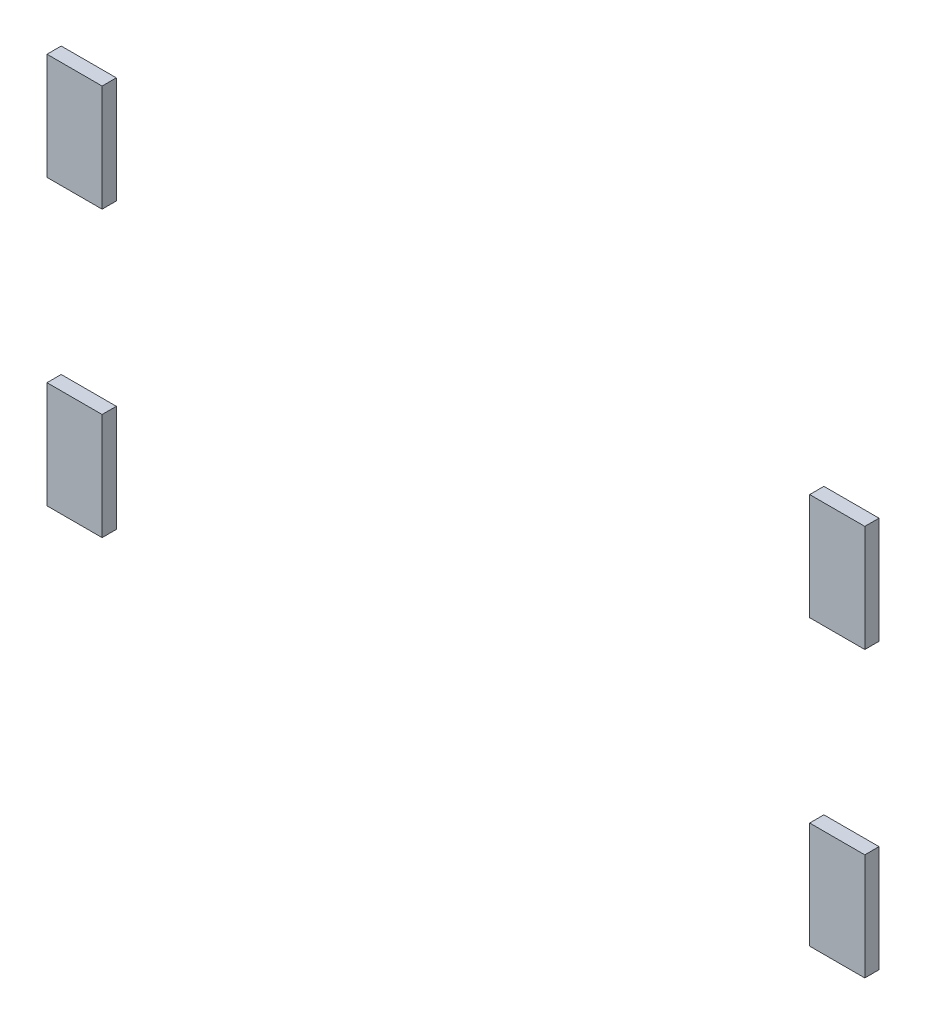
ISO-10303-21;
HEADER;
FILE_DESCRIPTION(('STEP AP214'),'2;1');
FILE_NAME('part.step','',(''),(''),'','','');
FILE_SCHEMA(('AUTOMOTIVE_DESIGN { 1 0 10303 214 1 1 1 1 }'));
ENDSEC;
DATA;
#1=APPLICATION_CONTEXT('core data for automotive mechanical design processes');
#2=APPLICATION_PROTOCOL_DEFINITION('international standard','automotive_design',2000,#1);
#3=PRODUCT_CONTEXT('',#1,'mechanical');
#4=PRODUCT('Part','Part','',(#3));
#5=PRODUCT_RELATED_PRODUCT_CATEGORY('part','',(#4));
#6=PRODUCT_DEFINITION_FORMATION('','',#4);
#7=PRODUCT_DEFINITION_CONTEXT('part definition',#1,'design');
#8=PRODUCT_DEFINITION('design','',#6,#7);
#9=PRODUCT_DEFINITION_SHAPE('','',#8);
#10=(LENGTH_UNIT() NAMED_UNIT(*) SI_UNIT(.MILLI.,.METRE.));
#11=(NAMED_UNIT(*) PLANE_ANGLE_UNIT() SI_UNIT($,.RADIAN.));
#12=(NAMED_UNIT(*) SI_UNIT($,.STERADIAN.) SOLID_ANGLE_UNIT());
#13=UNCERTAINTY_MEASURE_WITH_UNIT(LENGTH_MEASURE(1.E-05),#10,'distance_accuracy_value','');
#14=(GEOMETRIC_REPRESENTATION_CONTEXT(3) GLOBAL_UNCERTAINTY_ASSIGNED_CONTEXT((#13)) GLOBAL_UNIT_ASSIGNED_CONTEXT((#10,
#11,#12)) REPRESENTATION_CONTEXT('',''));
#15=CARTESIAN_POINT('',(0.,0.,0.));
#16=DIRECTION('',(0.,0.,1.));
#17=DIRECTION('',(1.,0.,0.));
#18=AXIS2_PLACEMENT_3D('',#15,#16,#17);
#19=CARTESIAN_POINT('',(0.,0.,0.));
#20=DIRECTION('',(0.,0.,-1.));
#21=DIRECTION('',(-1.,0.,0.));
#22=AXIS2_PLACEMENT_3D('',#19,#20,#21);
#23=PLANE('',#22);
#24=DIRECTION('',(1.,0.,0.));
#25=VECTOR('',#24,1.);
#26=CARTESIAN_POINT('',(-2.145,1.1,0.));
#27=LINE('',#26,#25);
#28=CARTESIAN_POINT('',(-1.99,1.1,0.));
#29=VERTEX_POINT('',#28);
#30=CARTESIAN_POINT('',(-2.3,1.1,0.));
#31=VERTEX_POINT('',#30);
#32=EDGE_CURVE('P0_E68',#29,#31,#27,.F.);
#33=ORIENTED_EDGE('',*,*,#32,.F.);
#34=DIRECTION('',(0.,1.,0.));
#35=VECTOR('',#34,1.);
#36=CARTESIAN_POINT('',(-1.99,0.8,0.));
#37=LINE('',#36,#35);
#38=CARTESIAN_POINT('',(-1.99,0.5,0.));
#39=VERTEX_POINT('',#38);
#40=EDGE_CURVE('P0_E20',#39,#29,#37,.T.);
#41=ORIENTED_EDGE('',*,*,#40,.F.);
#42=DIRECTION('',(1.,0.,0.));
#43=VECTOR('',#42,1.);
#44=CARTESIAN_POINT('',(-2.145,0.5,0.));
#45=LINE('',#44,#43);
#46=CARTESIAN_POINT('',(-2.3,0.5,0.));
#47=VERTEX_POINT('',#46);
#48=EDGE_CURVE('P0_E58',#47,#39,#45,.T.);
#49=ORIENTED_EDGE('',*,*,#48,.F.);
#50=DIRECTION('',(0.,1.,0.));
#51=VECTOR('',#50,1.);
#52=CARTESIAN_POINT('',(-2.3,0.8,0.));
#53=LINE('',#52,#51);
#54=EDGE_CURVE('P0_E53',#31,#47,#53,.F.);
#55=ORIENTED_EDGE('',*,*,#54,.F.);
#56=EDGE_LOOP('',(#33,#41,#49,#55));
#57=FACE_BOUND('',#56,.T.);
#58=ADVANCED_FACE('P0_F17',(#57),#23,.T.);
#59=CARTESIAN_POINT('',(-1.99,0.8,0.));
#60=DIRECTION('',(1.,0.,0.));
#61=DIRECTION('',(0.,0.,-1.));
#62=AXIS2_PLACEMENT_3D('',#59,#60,#61);
#63=PLANE('',#62);
#64=DIRECTION('',(0.,1.,0.));
#65=VECTOR('',#64,1.);
#66=CARTESIAN_POINT('',(-1.99,0.,0.08));
#67=LINE('',#66,#65);
#68=CARTESIAN_POINT('',(-1.99,1.1,0.08));
#69=VERTEX_POINT('',#68);
#70=CARTESIAN_POINT('',(-1.99,0.5,0.08));
#71=VERTEX_POINT('',#70);
#72=EDGE_CURVE('P0_E74',#69,#71,#67,.F.);
#73=ORIENTED_EDGE('',*,*,#72,.T.);
#74=DIRECTION('',(0.,0.,-1.));
#75=VECTOR('',#74,1.);
#76=CARTESIAN_POINT('',(-1.99,0.5,0.));
#77=LINE('',#76,#75);
#78=EDGE_CURVE('P0_E63',#39,#71,#77,.F.);
#79=ORIENTED_EDGE('',*,*,#78,.F.);
#80=ORIENTED_EDGE('',*,*,#40,.T.);
#81=DIRECTION('',(0.,0.,1.));
#82=VECTOR('',#81,1.);
#83=CARTESIAN_POINT('',(-1.99,1.1,0.));
#84=LINE('',#83,#82);
#85=EDGE_CURVE('P0_E81',#69,#29,#84,.F.);
#86=ORIENTED_EDGE('',*,*,#85,.F.);
#87=EDGE_LOOP('',(#73,#79,#80,#86));
#88=FACE_BOUND('',#87,.T.);
#89=ADVANCED_FACE('P0_F73',(#88),#63,.T.);
#90=CARTESIAN_POINT('',(-2.145,0.5,0.));
#91=DIRECTION('',(0.,-1.,0.));
#92=DIRECTION('',(0.,0.,-1.));
#93=AXIS2_PLACEMENT_3D('',#90,#91,#92);
#94=PLANE('',#93);
#95=DIRECTION('',(-1.,0.,0.));
#96=VECTOR('',#95,1.);
#97=CARTESIAN_POINT('',(0.,0.5,0.08));
#98=LINE('',#97,#96);
#99=CARTESIAN_POINT('',(-2.3,0.5,0.08));
#100=VERTEX_POINT('',#99);
#101=EDGE_CURVE('P0_E84',#71,#100,#98,.T.);
#102=ORIENTED_EDGE('',*,*,#101,.T.);
#103=DIRECTION('',(0.,0.,1.));
#104=VECTOR('',#103,1.);
#105=CARTESIAN_POINT('',(-2.3,0.5,0.));
#106=LINE('',#105,#104);
#107=EDGE_CURVE('P0_E65',#47,#100,#106,.T.);
#108=ORIENTED_EDGE('',*,*,#107,.F.);
#109=ORIENTED_EDGE('',*,*,#48,.T.);
#110=ORIENTED_EDGE('',*,*,#78,.T.);
#111=EDGE_LOOP('',(#102,#108,#109,#110));
#112=FACE_BOUND('',#111,.T.);
#113=ADVANCED_FACE('P0_F61',(#112),#94,.T.);
#114=CARTESIAN_POINT('',(-2.3,0.8,0.));
#115=DIRECTION('',(-1.,0.,0.));
#116=DIRECTION('',(0.,0.,1.));
#117=AXIS2_PLACEMENT_3D('',#114,#115,#116);
#118=PLANE('',#117);
#119=DIRECTION('',(0.,1.,0.));
#120=VECTOR('',#119,1.);
#121=CARTESIAN_POINT('',(-2.3,0.,0.08));
#122=LINE('',#121,#120);
#123=CARTESIAN_POINT('',(-2.3,1.1,0.08));
#124=VERTEX_POINT('',#123);
#125=EDGE_CURVE('P0_E26',#100,#124,#122,.T.);
#126=ORIENTED_EDGE('',*,*,#125,.T.);
#127=DIRECTION('',(0.,0.,1.));
#128=VECTOR('',#127,1.);
#129=CARTESIAN_POINT('',(-2.3,1.1,0.));
#130=LINE('',#129,#128);
#131=EDGE_CURVE('P0_E34',#31,#124,#130,.T.);
#132=ORIENTED_EDGE('',*,*,#131,.F.);
#133=ORIENTED_EDGE('',*,*,#54,.T.);
#134=ORIENTED_EDGE('',*,*,#107,.T.);
#135=EDGE_LOOP('',(#126,#132,#133,#134));
#136=FACE_BOUND('',#135,.T.);
#137=ADVANCED_FACE('P0_F88',(#136),#118,.T.);
#138=CARTESIAN_POINT('',(-2.145,1.1,0.));
#139=DIRECTION('',(0.,1.,0.));
#140=DIRECTION('',(0.,0.,1.));
#141=AXIS2_PLACEMENT_3D('',#138,#139,#140);
#142=PLANE('',#141);
#143=DIRECTION('',(-1.,0.,0.));
#144=VECTOR('',#143,1.);
#145=CARTESIAN_POINT('',(0.,1.1,0.08));
#146=LINE('',#145,#144);
#147=EDGE_CURVE('P0_E11',#124,#69,#146,.F.);
#148=ORIENTED_EDGE('',*,*,#147,.T.);
#149=ORIENTED_EDGE('',*,*,#85,.T.);
#150=ORIENTED_EDGE('',*,*,#32,.T.);
#151=ORIENTED_EDGE('',*,*,#131,.T.);
#152=EDGE_LOOP('',(#148,#149,#150,#151));
#153=FACE_BOUND('',#152,.T.);
#154=ADVANCED_FACE('P0_F91',(#153),#142,.T.);
#155=CARTESIAN_POINT('',(0.,0.,0.08));
#156=DIRECTION('',(0.,0.,-1.));
#157=DIRECTION('',(-1.,0.,0.));
#158=AXIS2_PLACEMENT_3D('',#155,#156,#157);
#159=PLANE('',#158);
#160=ORIENTED_EDGE('',*,*,#125,.F.);
#161=ORIENTED_EDGE('',*,*,#101,.F.);
#162=ORIENTED_EDGE('',*,*,#72,.F.);
#163=ORIENTED_EDGE('',*,*,#147,.F.);
#164=EDGE_LOOP('',(#160,#161,#162,#163));
#165=FACE_BOUND('',#164,.T.);
#166=ADVANCED_FACE('P0_F90',(#165),#159,.F.);
#167=CLOSED_SHELL('',(#58,#89,#113,#137,#154,#166));
#168=MANIFOLD_SOLID_BREP('P0_B1',#167);
#169=CARTESIAN_POINT('',(0.,0.,0.));
#170=DIRECTION('',(0.,0.,-1.));
#171=DIRECTION('',(-1.,0.,0.));
#172=AXIS2_PLACEMENT_3D('',#169,#170,#171);
#173=PLANE('',#172);
#174=DIRECTION('',(1.,0.,0.));
#175=VECTOR('',#174,1.);
#176=CARTESIAN_POINT('',(-2.145,-0.5,0.));
#177=LINE('',#176,#175);
#178=CARTESIAN_POINT('',(-1.99,-0.5,0.));
#179=VERTEX_POINT('',#178);
#180=CARTESIAN_POINT('',(-2.3,-0.5,0.));
#181=VERTEX_POINT('',#180);
#182=EDGE_CURVE('P1_E68',#179,#181,#177,.F.);
#183=ORIENTED_EDGE('',*,*,#182,.F.);
#184=DIRECTION('',(0.,1.,0.));
#185=VECTOR('',#184,1.);
#186=CARTESIAN_POINT('',(-1.99,-0.8,0.));
#187=LINE('',#186,#185);
#188=CARTESIAN_POINT('',(-1.99,-1.1,0.));
#189=VERTEX_POINT('',#188);
#190=EDGE_CURVE('P1_E20',#189,#179,#187,.T.);
#191=ORIENTED_EDGE('',*,*,#190,.F.);
#192=DIRECTION('',(1.,0.,0.));
#193=VECTOR('',#192,1.);
#194=CARTESIAN_POINT('',(-2.145,-1.1,0.));
#195=LINE('',#194,#193);
#196=CARTESIAN_POINT('',(-2.3,-1.1,0.));
#197=VERTEX_POINT('',#196);
#198=EDGE_CURVE('P1_E58',#197,#189,#195,.T.);
#199=ORIENTED_EDGE('',*,*,#198,.F.);
#200=DIRECTION('',(0.,1.,0.));
#201=VECTOR('',#200,1.);
#202=CARTESIAN_POINT('',(-2.3,-0.8,0.));
#203=LINE('',#202,#201);
#204=EDGE_CURVE('P1_E53',#181,#197,#203,.F.);
#205=ORIENTED_EDGE('',*,*,#204,.F.);
#206=EDGE_LOOP('',(#183,#191,#199,#205));
#207=FACE_BOUND('',#206,.T.);
#208=ADVANCED_FACE('P1_F17',(#207),#173,.T.);
#209=CARTESIAN_POINT('',(-1.99,-0.8,0.));
#210=DIRECTION('',(1.,0.,0.));
#211=DIRECTION('',(0.,0.,-1.));
#212=AXIS2_PLACEMENT_3D('',#209,#210,#211);
#213=PLANE('',#212);
#214=DIRECTION('',(0.,1.,0.));
#215=VECTOR('',#214,1.);
#216=CARTESIAN_POINT('',(-1.99,0.,0.08));
#217=LINE('',#216,#215);
#218=CARTESIAN_POINT('',(-1.99,-0.5,0.08));
#219=VERTEX_POINT('',#218);
#220=CARTESIAN_POINT('',(-1.99,-1.1,0.08));
#221=VERTEX_POINT('',#220);
#222=EDGE_CURVE('P1_E74',#219,#221,#217,.F.);
#223=ORIENTED_EDGE('',*,*,#222,.T.);
#224=DIRECTION('',(0.,0.,-1.));
#225=VECTOR('',#224,1.);
#226=CARTESIAN_POINT('',(-1.99,-1.1,0.));
#227=LINE('',#226,#225);
#228=EDGE_CURVE('P1_E63',#189,#221,#227,.F.);
#229=ORIENTED_EDGE('',*,*,#228,.F.);
#230=ORIENTED_EDGE('',*,*,#190,.T.);
#231=DIRECTION('',(0.,0.,1.));
#232=VECTOR('',#231,1.);
#233=CARTESIAN_POINT('',(-1.99,-0.5,0.));
#234=LINE('',#233,#232);
#235=EDGE_CURVE('P1_E81',#219,#179,#234,.F.);
#236=ORIENTED_EDGE('',*,*,#235,.F.);
#237=EDGE_LOOP('',(#223,#229,#230,#236));
#238=FACE_BOUND('',#237,.T.);
#239=ADVANCED_FACE('P1_F73',(#238),#213,.T.);
#240=CARTESIAN_POINT('',(-2.145,-1.1,0.));
#241=DIRECTION('',(0.,-1.,0.));
#242=DIRECTION('',(0.,0.,-1.));
#243=AXIS2_PLACEMENT_3D('',#240,#241,#242);
#244=PLANE('',#243);
#245=DIRECTION('',(-1.,0.,0.));
#246=VECTOR('',#245,1.);
#247=CARTESIAN_POINT('',(0.,-1.1,0.08));
#248=LINE('',#247,#246);
#249=CARTESIAN_POINT('',(-2.3,-1.1,0.08));
#250=VERTEX_POINT('',#249);
#251=EDGE_CURVE('P1_E84',#221,#250,#248,.T.);
#252=ORIENTED_EDGE('',*,*,#251,.T.);
#253=DIRECTION('',(0.,0.,1.));
#254=VECTOR('',#253,1.);
#255=CARTESIAN_POINT('',(-2.3,-1.1,0.));
#256=LINE('',#255,#254);
#257=EDGE_CURVE('P1_E65',#197,#250,#256,.T.);
#258=ORIENTED_EDGE('',*,*,#257,.F.);
#259=ORIENTED_EDGE('',*,*,#198,.T.);
#260=ORIENTED_EDGE('',*,*,#228,.T.);
#261=EDGE_LOOP('',(#252,#258,#259,#260));
#262=FACE_BOUND('',#261,.T.);
#263=ADVANCED_FACE('P1_F61',(#262),#244,.T.);
#264=CARTESIAN_POINT('',(-2.3,-0.8,0.));
#265=DIRECTION('',(-1.,0.,0.));
#266=DIRECTION('',(0.,0.,1.));
#267=AXIS2_PLACEMENT_3D('',#264,#265,#266);
#268=PLANE('',#267);
#269=DIRECTION('',(0.,1.,0.));
#270=VECTOR('',#269,1.);
#271=CARTESIAN_POINT('',(-2.3,0.,0.08));
#272=LINE('',#271,#270);
#273=CARTESIAN_POINT('',(-2.3,-0.5,0.08));
#274=VERTEX_POINT('',#273);
#275=EDGE_CURVE('P1_E26',#250,#274,#272,.T.);
#276=ORIENTED_EDGE('',*,*,#275,.T.);
#277=DIRECTION('',(0.,0.,1.));
#278=VECTOR('',#277,1.);
#279=CARTESIAN_POINT('',(-2.3,-0.5,0.));
#280=LINE('',#279,#278);
#281=EDGE_CURVE('P1_E34',#181,#274,#280,.T.);
#282=ORIENTED_EDGE('',*,*,#281,.F.);
#283=ORIENTED_EDGE('',*,*,#204,.T.);
#284=ORIENTED_EDGE('',*,*,#257,.T.);
#285=EDGE_LOOP('',(#276,#282,#283,#284));
#286=FACE_BOUND('',#285,.T.);
#287=ADVANCED_FACE('P1_F88',(#286),#268,.T.);
#288=CARTESIAN_POINT('',(-2.145,-0.5,0.));
#289=DIRECTION('',(0.,1.,0.));
#290=DIRECTION('',(0.,0.,1.));
#291=AXIS2_PLACEMENT_3D('',#288,#289,#290);
#292=PLANE('',#291);
#293=DIRECTION('',(-1.,0.,0.));
#294=VECTOR('',#293,1.);
#295=CARTESIAN_POINT('',(0.,-0.5,0.08));
#296=LINE('',#295,#294);
#297=EDGE_CURVE('P1_E11',#274,#219,#296,.F.);
#298=ORIENTED_EDGE('',*,*,#297,.T.);
#299=ORIENTED_EDGE('',*,*,#235,.T.);
#300=ORIENTED_EDGE('',*,*,#182,.T.);
#301=ORIENTED_EDGE('',*,*,#281,.T.);
#302=EDGE_LOOP('',(#298,#299,#300,#301));
#303=FACE_BOUND('',#302,.T.);
#304=ADVANCED_FACE('P1_F91',(#303),#292,.T.);
#305=CARTESIAN_POINT('',(0.,0.,0.08));
#306=DIRECTION('',(0.,0.,-1.));
#307=DIRECTION('',(-1.,0.,0.));
#308=AXIS2_PLACEMENT_3D('',#305,#306,#307);
#309=PLANE('',#308);
#310=ORIENTED_EDGE('',*,*,#275,.F.);
#311=ORIENTED_EDGE('',*,*,#251,.F.);
#312=ORIENTED_EDGE('',*,*,#222,.F.);
#313=ORIENTED_EDGE('',*,*,#297,.F.);
#314=EDGE_LOOP('',(#310,#311,#312,#313));
#315=FACE_BOUND('',#314,.T.);
#316=ADVANCED_FACE('P1_F90',(#315),#309,.F.);
#317=CLOSED_SHELL('',(#208,#239,#263,#287,#304,#316));
#318=MANIFOLD_SOLID_BREP('P1_B1',#317);
#319=CARTESIAN_POINT('',(0.,0.,0.));
#320=DIRECTION('',(0.,0.,-1.));
#321=DIRECTION('',(-1.,0.,0.));
#322=AXIS2_PLACEMENT_3D('',#319,#320,#321);
#323=PLANE('',#322);
#324=DIRECTION('',(1.,0.,0.));
#325=VECTOR('',#324,1.);
#326=CARTESIAN_POINT('',(2.145,-1.1,0.));
#327=LINE('',#326,#325);
#328=CARTESIAN_POINT('',(1.99,-1.1,0.));
#329=VERTEX_POINT('',#328);
#330=CARTESIAN_POINT('',(2.3,-1.1,0.));
#331=VERTEX_POINT('',#330);
#332=EDGE_CURVE('P2_E68',#329,#331,#327,.T.);
#333=ORIENTED_EDGE('',*,*,#332,.F.);
#334=DIRECTION('',(0.,1.,0.));
#335=VECTOR('',#334,1.);
#336=CARTESIAN_POINT('',(1.99,-0.8,0.));
#337=LINE('',#336,#335);
#338=CARTESIAN_POINT('',(1.99,-0.5,0.));
#339=VERTEX_POINT('',#338);
#340=EDGE_CURVE('P2_E20',#339,#329,#337,.F.);
#341=ORIENTED_EDGE('',*,*,#340,.F.);
#342=DIRECTION('',(1.,0.,0.));
#343=VECTOR('',#342,1.);
#344=CARTESIAN_POINT('',(2.145,-0.5,0.));
#345=LINE('',#344,#343);
#346=CARTESIAN_POINT('',(2.3,-0.5,0.));
#347=VERTEX_POINT('',#346);
#348=EDGE_CURVE('P2_E58',#347,#339,#345,.F.);
#349=ORIENTED_EDGE('',*,*,#348,.F.);
#350=DIRECTION('',(0.,1.,0.));
#351=VECTOR('',#350,1.);
#352=CARTESIAN_POINT('',(2.3,-0.8,0.));
#353=LINE('',#352,#351);
#354=EDGE_CURVE('P2_E53',#331,#347,#353,.T.);
#355=ORIENTED_EDGE('',*,*,#354,.F.);
#356=EDGE_LOOP('',(#333,#341,#349,#355));
#357=FACE_BOUND('',#356,.T.);
#358=ADVANCED_FACE('P2_F17',(#357),#323,.T.);
#359=CARTESIAN_POINT('',(1.99,-0.8,0.));
#360=DIRECTION('',(-1.,0.,0.));
#361=DIRECTION('',(0.,0.,1.));
#362=AXIS2_PLACEMENT_3D('',#359,#360,#361);
#363=PLANE('',#362);
#364=DIRECTION('',(0.,1.,0.));
#365=VECTOR('',#364,1.);
#366=CARTESIAN_POINT('',(1.99,0.,0.08));
#367=LINE('',#366,#365);
#368=CARTESIAN_POINT('',(1.99,-1.1,0.08));
#369=VERTEX_POINT('',#368);
#370=CARTESIAN_POINT('',(1.99,-0.5,0.08));
#371=VERTEX_POINT('',#370);
#372=EDGE_CURVE('P2_E74',#369,#371,#367,.T.);
#373=ORIENTED_EDGE('',*,*,#372,.T.);
#374=DIRECTION('',(0.,0.,1.));
#375=VECTOR('',#374,1.);
#376=CARTESIAN_POINT('',(1.99,-0.5,0.));
#377=LINE('',#376,#375);
#378=EDGE_CURVE('P2_E63',#339,#371,#377,.T.);
#379=ORIENTED_EDGE('',*,*,#378,.F.);
#380=ORIENTED_EDGE('',*,*,#340,.T.);
#381=DIRECTION('',(0.,0.,-1.));
#382=VECTOR('',#381,1.);
#383=CARTESIAN_POINT('',(1.99,-1.1,0.));
#384=LINE('',#383,#382);
#385=EDGE_CURVE('P2_E81',#369,#329,#384,.T.);
#386=ORIENTED_EDGE('',*,*,#385,.F.);
#387=EDGE_LOOP('',(#373,#379,#380,#386));
#388=FACE_BOUND('',#387,.T.);
#389=ADVANCED_FACE('P2_F73',(#388),#363,.T.);
#390=CARTESIAN_POINT('',(2.145,-0.5,0.));
#391=DIRECTION('',(0.,1.,0.));
#392=DIRECTION('',(0.,0.,1.));
#393=AXIS2_PLACEMENT_3D('',#390,#391,#392);
#394=PLANE('',#393);
#395=DIRECTION('',(-1.,0.,0.));
#396=VECTOR('',#395,1.);
#397=CARTESIAN_POINT('',(0.,-0.5,0.08));
#398=LINE('',#397,#396);
#399=CARTESIAN_POINT('',(2.3,-0.5,0.08));
#400=VERTEX_POINT('',#399);
#401=EDGE_CURVE('P2_E84',#371,#400,#398,.F.);
#402=ORIENTED_EDGE('',*,*,#401,.T.);
#403=DIRECTION('',(0.,0.,-1.));
#404=VECTOR('',#403,1.);
#405=CARTESIAN_POINT('',(2.3,-0.5,0.));
#406=LINE('',#405,#404);
#407=EDGE_CURVE('P2_E65',#347,#400,#406,.F.);
#408=ORIENTED_EDGE('',*,*,#407,.F.);
#409=ORIENTED_EDGE('',*,*,#348,.T.);
#410=ORIENTED_EDGE('',*,*,#378,.T.);
#411=EDGE_LOOP('',(#402,#408,#409,#410));
#412=FACE_BOUND('',#411,.T.);
#413=ADVANCED_FACE('P2_F61',(#412),#394,.T.);
#414=CARTESIAN_POINT('',(2.3,-0.8,0.));
#415=DIRECTION('',(1.,0.,0.));
#416=DIRECTION('',(0.,0.,-1.));
#417=AXIS2_PLACEMENT_3D('',#414,#415,#416);
#418=PLANE('',#417);
#419=DIRECTION('',(0.,1.,0.));
#420=VECTOR('',#419,1.);
#421=CARTESIAN_POINT('',(2.3,0.,0.08));
#422=LINE('',#421,#420);
#423=CARTESIAN_POINT('',(2.3,-1.1,0.08));
#424=VERTEX_POINT('',#423);
#425=EDGE_CURVE('P2_E26',#400,#424,#422,.F.);
#426=ORIENTED_EDGE('',*,*,#425,.T.);
#427=DIRECTION('',(0.,0.,-1.));
#428=VECTOR('',#427,1.);
#429=CARTESIAN_POINT('',(2.3,-1.1,0.));
#430=LINE('',#429,#428);
#431=EDGE_CURVE('P2_E34',#331,#424,#430,.F.);
#432=ORIENTED_EDGE('',*,*,#431,.F.);
#433=ORIENTED_EDGE('',*,*,#354,.T.);
#434=ORIENTED_EDGE('',*,*,#407,.T.);
#435=EDGE_LOOP('',(#426,#432,#433,#434));
#436=FACE_BOUND('',#435,.T.);
#437=ADVANCED_FACE('P2_F88',(#436),#418,.T.);
#438=CARTESIAN_POINT('',(2.145,-1.1,0.));
#439=DIRECTION('',(0.,-1.,0.));
#440=DIRECTION('',(0.,0.,-1.));
#441=AXIS2_PLACEMENT_3D('',#438,#439,#440);
#442=PLANE('',#441);
#443=DIRECTION('',(-1.,0.,0.));
#444=VECTOR('',#443,1.);
#445=CARTESIAN_POINT('',(0.,-1.1,0.08));
#446=LINE('',#445,#444);
#447=EDGE_CURVE('P2_E11',#424,#369,#446,.T.);
#448=ORIENTED_EDGE('',*,*,#447,.T.);
#449=ORIENTED_EDGE('',*,*,#385,.T.);
#450=ORIENTED_EDGE('',*,*,#332,.T.);
#451=ORIENTED_EDGE('',*,*,#431,.T.);
#452=EDGE_LOOP('',(#448,#449,#450,#451));
#453=FACE_BOUND('',#452,.T.);
#454=ADVANCED_FACE('P2_F91',(#453),#442,.T.);
#455=CARTESIAN_POINT('',(0.,0.,0.08));
#456=DIRECTION('',(0.,0.,-1.));
#457=DIRECTION('',(-1.,0.,0.));
#458=AXIS2_PLACEMENT_3D('',#455,#456,#457);
#459=PLANE('',#458);
#460=ORIENTED_EDGE('',*,*,#425,.F.);
#461=ORIENTED_EDGE('',*,*,#401,.F.);
#462=ORIENTED_EDGE('',*,*,#372,.F.);
#463=ORIENTED_EDGE('',*,*,#447,.F.);
#464=EDGE_LOOP('',(#460,#461,#462,#463));
#465=FACE_BOUND('',#464,.T.);
#466=ADVANCED_FACE('P2_F90',(#465),#459,.F.);
#467=CLOSED_SHELL('',(#358,#389,#413,#437,#454,#466));
#468=MANIFOLD_SOLID_BREP('P2_B1',#467);
#469=CARTESIAN_POINT('',(0.,0.,0.));
#470=DIRECTION('',(0.,0.,-1.));
#471=DIRECTION('',(-1.,0.,0.));
#472=AXIS2_PLACEMENT_3D('',#469,#470,#471);
#473=PLANE('',#472);
#474=DIRECTION('',(1.,0.,0.));
#475=VECTOR('',#474,1.);
#476=CARTESIAN_POINT('',(2.145,0.5,0.));
#477=LINE('',#476,#475);
#478=CARTESIAN_POINT('',(1.99,0.5,0.));
#479=VERTEX_POINT('',#478);
#480=CARTESIAN_POINT('',(2.3,0.5,0.));
#481=VERTEX_POINT('',#480);
#482=EDGE_CURVE('P3_E68',#479,#481,#477,.T.);
#483=ORIENTED_EDGE('',*,*,#482,.F.);
#484=DIRECTION('',(0.,1.,0.));
#485=VECTOR('',#484,1.);
#486=CARTESIAN_POINT('',(1.99,0.8,0.));
#487=LINE('',#486,#485);
#488=CARTESIAN_POINT('',(1.99,1.1,0.));
#489=VERTEX_POINT('',#488);
#490=EDGE_CURVE('P3_E20',#489,#479,#487,.F.);
#491=ORIENTED_EDGE('',*,*,#490,.F.);
#492=DIRECTION('',(1.,0.,0.));
#493=VECTOR('',#492,1.);
#494=CARTESIAN_POINT('',(2.145,1.1,0.));
#495=LINE('',#494,#493);
#496=CARTESIAN_POINT('',(2.3,1.1,0.));
#497=VERTEX_POINT('',#496);
#498=EDGE_CURVE('P3_E58',#497,#489,#495,.F.);
#499=ORIENTED_EDGE('',*,*,#498,.F.);
#500=DIRECTION('',(0.,1.,0.));
#501=VECTOR('',#500,1.);
#502=CARTESIAN_POINT('',(2.3,0.8,0.));
#503=LINE('',#502,#501);
#504=EDGE_CURVE('P3_E53',#481,#497,#503,.T.);
#505=ORIENTED_EDGE('',*,*,#504,.F.);
#506=EDGE_LOOP('',(#483,#491,#499,#505));
#507=FACE_BOUND('',#506,.T.);
#508=ADVANCED_FACE('P3_F17',(#507),#473,.T.);
#509=CARTESIAN_POINT('',(1.99,0.8,0.));
#510=DIRECTION('',(-1.,0.,0.));
#511=DIRECTION('',(0.,0.,1.));
#512=AXIS2_PLACEMENT_3D('',#509,#510,#511);
#513=PLANE('',#512);
#514=DIRECTION('',(0.,1.,0.));
#515=VECTOR('',#514,1.);
#516=CARTESIAN_POINT('',(1.99,0.,0.08));
#517=LINE('',#516,#515);
#518=CARTESIAN_POINT('',(1.99,0.5,0.08));
#519=VERTEX_POINT('',#518);
#520=CARTESIAN_POINT('',(1.99,1.1,0.08));
#521=VERTEX_POINT('',#520);
#522=EDGE_CURVE('P3_E74',#519,#521,#517,.T.);
#523=ORIENTED_EDGE('',*,*,#522,.T.);
#524=DIRECTION('',(0.,0.,1.));
#525=VECTOR('',#524,1.);
#526=CARTESIAN_POINT('',(1.99,1.1,0.));
#527=LINE('',#526,#525);
#528=EDGE_CURVE('P3_E63',#489,#521,#527,.T.);
#529=ORIENTED_EDGE('',*,*,#528,.F.);
#530=ORIENTED_EDGE('',*,*,#490,.T.);
#531=DIRECTION('',(0.,0.,-1.));
#532=VECTOR('',#531,1.);
#533=CARTESIAN_POINT('',(1.99,0.5,0.));
#534=LINE('',#533,#532);
#535=EDGE_CURVE('P3_E81',#519,#479,#534,.T.);
#536=ORIENTED_EDGE('',*,*,#535,.F.);
#537=EDGE_LOOP('',(#523,#529,#530,#536));
#538=FACE_BOUND('',#537,.T.);
#539=ADVANCED_FACE('P3_F73',(#538),#513,.T.);
#540=CARTESIAN_POINT('',(2.145,1.1,0.));
#541=DIRECTION('',(0.,1.,0.));
#542=DIRECTION('',(0.,0.,1.));
#543=AXIS2_PLACEMENT_3D('',#540,#541,#542);
#544=PLANE('',#543);
#545=DIRECTION('',(-1.,0.,0.));
#546=VECTOR('',#545,1.);
#547=CARTESIAN_POINT('',(0.,1.1,0.08));
#548=LINE('',#547,#546);
#549=CARTESIAN_POINT('',(2.3,1.1,0.08));
#550=VERTEX_POINT('',#549);
#551=EDGE_CURVE('P3_E84',#521,#550,#548,.F.);
#552=ORIENTED_EDGE('',*,*,#551,.T.);
#553=DIRECTION('',(0.,0.,-1.));
#554=VECTOR('',#553,1.);
#555=CARTESIAN_POINT('',(2.3,1.1,0.));
#556=LINE('',#555,#554);
#557=EDGE_CURVE('P3_E65',#497,#550,#556,.F.);
#558=ORIENTED_EDGE('',*,*,#557,.F.);
#559=ORIENTED_EDGE('',*,*,#498,.T.);
#560=ORIENTED_EDGE('',*,*,#528,.T.);
#561=EDGE_LOOP('',(#552,#558,#559,#560));
#562=FACE_BOUND('',#561,.T.);
#563=ADVANCED_FACE('P3_F61',(#562),#544,.T.);
#564=CARTESIAN_POINT('',(2.3,0.8,0.));
#565=DIRECTION('',(1.,0.,0.));
#566=DIRECTION('',(0.,0.,-1.));
#567=AXIS2_PLACEMENT_3D('',#564,#565,#566);
#568=PLANE('',#567);
#569=DIRECTION('',(0.,1.,0.));
#570=VECTOR('',#569,1.);
#571=CARTESIAN_POINT('',(2.3,0.,0.08));
#572=LINE('',#571,#570);
#573=CARTESIAN_POINT('',(2.3,0.5,0.08));
#574=VERTEX_POINT('',#573);
#575=EDGE_CURVE('P3_E26',#550,#574,#572,.F.);
#576=ORIENTED_EDGE('',*,*,#575,.T.);
#577=DIRECTION('',(0.,0.,-1.));
#578=VECTOR('',#577,1.);
#579=CARTESIAN_POINT('',(2.3,0.5,0.));
#580=LINE('',#579,#578);
#581=EDGE_CURVE('P3_E34',#481,#574,#580,.F.);
#582=ORIENTED_EDGE('',*,*,#581,.F.);
#583=ORIENTED_EDGE('',*,*,#504,.T.);
#584=ORIENTED_EDGE('',*,*,#557,.T.);
#585=EDGE_LOOP('',(#576,#582,#583,#584));
#586=FACE_BOUND('',#585,.T.);
#587=ADVANCED_FACE('P3_F88',(#586),#568,.T.);
#588=CARTESIAN_POINT('',(2.145,0.5,0.));
#589=DIRECTION('',(0.,-1.,0.));
#590=DIRECTION('',(0.,0.,-1.));
#591=AXIS2_PLACEMENT_3D('',#588,#589,#590);
#592=PLANE('',#591);
#593=DIRECTION('',(-1.,0.,0.));
#594=VECTOR('',#593,1.);
#595=CARTESIAN_POINT('',(0.,0.5,0.08));
#596=LINE('',#595,#594);
#597=EDGE_CURVE('P3_E11',#574,#519,#596,.T.);
#598=ORIENTED_EDGE('',*,*,#597,.T.);
#599=ORIENTED_EDGE('',*,*,#535,.T.);
#600=ORIENTED_EDGE('',*,*,#482,.T.);
#601=ORIENTED_EDGE('',*,*,#581,.T.);
#602=EDGE_LOOP('',(#598,#599,#600,#601));
#603=FACE_BOUND('',#602,.T.);
#604=ADVANCED_FACE('P3_F91',(#603),#592,.T.);
#605=CARTESIAN_POINT('',(0.,0.,0.08));
#606=DIRECTION('',(0.,0.,-1.));
#607=DIRECTION('',(-1.,0.,0.));
#608=AXIS2_PLACEMENT_3D('',#605,#606,#607);
#609=PLANE('',#608);
#610=ORIENTED_EDGE('',*,*,#575,.F.);
#611=ORIENTED_EDGE('',*,*,#551,.F.);
#612=ORIENTED_EDGE('',*,*,#522,.F.);
#613=ORIENTED_EDGE('',*,*,#597,.F.);
#614=EDGE_LOOP('',(#610,#611,#612,#613));
#615=FACE_BOUND('',#614,.T.);
#616=ADVANCED_FACE('P3_F90',(#615),#609,.F.);
#617=CLOSED_SHELL('',(#508,#539,#563,#587,#604,#616));
#618=MANIFOLD_SOLID_BREP('P3_B1',#617);
#619=ADVANCED_BREP_SHAPE_REPRESENTATION('',(#18,#168,#318,#468,#618),#14);
#620=SHAPE_DEFINITION_REPRESENTATION(#9,#619);
ENDSEC;
END-ISO-10303-21;
